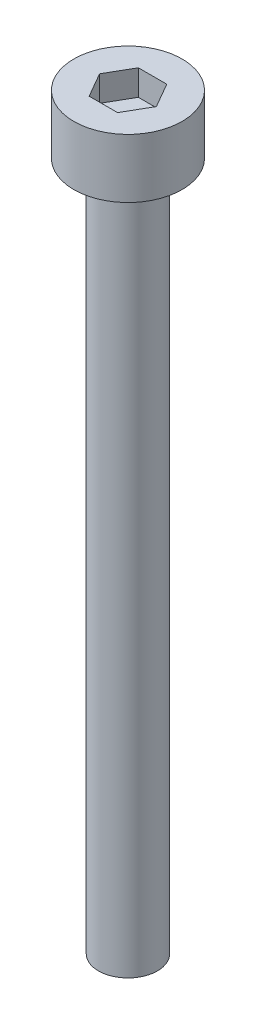
ISO-10303-21;
HEADER;
FILE_DESCRIPTION(('STEP AP214'),'2;1');
FILE_NAME('part.step','',(''),(''),'','','');
FILE_SCHEMA(('AUTOMOTIVE_DESIGN { 1 0 10303 214 1 1 1 1 }'));
ENDSEC;
DATA;
#1=APPLICATION_CONTEXT('core data for automotive mechanical design processes');
#2=APPLICATION_PROTOCOL_DEFINITION('international standard','automotive_design',2000,#1);
#3=PRODUCT_CONTEXT('',#1,'mechanical');
#4=PRODUCT('Part','Part','',(#3));
#5=PRODUCT_RELATED_PRODUCT_CATEGORY('part','',(#4));
#6=PRODUCT_DEFINITION_FORMATION('','',#4);
#7=PRODUCT_DEFINITION_CONTEXT('part definition',#1,'design');
#8=PRODUCT_DEFINITION('design','',#6,#7);
#9=PRODUCT_DEFINITION_SHAPE('','',#8);
#10=(LENGTH_UNIT() NAMED_UNIT(*) SI_UNIT(.MILLI.,.METRE.));
#11=(NAMED_UNIT(*) PLANE_ANGLE_UNIT() SI_UNIT($,.RADIAN.));
#12=(NAMED_UNIT(*) SI_UNIT($,.STERADIAN.) SOLID_ANGLE_UNIT());
#13=UNCERTAINTY_MEASURE_WITH_UNIT(LENGTH_MEASURE(1.E-05),#10,'distance_accuracy_value','');
#14=(GEOMETRIC_REPRESENTATION_CONTEXT(3) GLOBAL_UNCERTAINTY_ASSIGNED_CONTEXT((#13)) GLOBAL_UNIT_ASSIGNED_CONTEXT((#10,
#11,#12)) REPRESENTATION_CONTEXT('',''));
#15=CARTESIAN_POINT('',(0.,0.,0.));
#16=DIRECTION('',(0.,0.,1.));
#17=DIRECTION('',(1.,0.,0.));
#18=AXIS2_PLACEMENT_3D('',#15,#16,#17);
#19=CARTESIAN_POINT('',(0.,3.,0.));
#20=DIRECTION('',(0.,-1.,0.));
#21=DIRECTION('',(0.,0.,-1.));
#22=AXIS2_PLACEMENT_3D('',#19,#20,#21);
#23=CYLINDRICAL_SURFACE('',#22,2.75);
#24=CARTESIAN_POINT('',(0.,3.,0.));
#25=DIRECTION('',(0.,1.,0.));
#26=DIRECTION('',(0.,0.,1.));
#27=AXIS2_PLACEMENT_3D('',#24,#25,#26);
#28=CIRCLE('',#27,2.75);
#29=CARTESIAN_POINT('',(0.,3.,2.75));
#30=VERTEX_POINT('',#29);
#31=EDGE_CURVE('E45',#30,#30,#28,.T.);
#32=ORIENTED_EDGE('',*,*,#31,.F.);
#33=EDGE_LOOP('',(#32));
#34=FACE_BOUND('',#33,.T.);
#35=CARTESIAN_POINT('',(0.,0.,0.));
#36=DIRECTION('',(0.,1.,0.));
#37=DIRECTION('',(0.,0.,1.));
#38=AXIS2_PLACEMENT_3D('',#35,#36,#37);
#39=CIRCLE('',#38,2.75);
#40=CARTESIAN_POINT('',(0.,0.,2.75));
#41=VERTEX_POINT('',#40);
#42=EDGE_CURVE('E40',#41,#41,#39,.T.);
#43=ORIENTED_EDGE('',*,*,#42,.T.);
#44=EDGE_LOOP('',(#43));
#45=FACE_BOUND('',#44,.T.);
#46=ADVANCED_FACE('F37',(#34,#45),#23,.T.);
#47=CARTESIAN_POINT('',(0.,3.,0.));
#48=DIRECTION('',(0.,1.,0.));
#49=DIRECTION('',(0.,0.,1.));
#50=AXIS2_PLACEMENT_3D('',#47,#48,#49);
#51=PLANE('',#50);
#52=DIRECTION('',(0.5,0.,-0.866025403784439));
#53=VECTOR('',#52,1.);
#54=CARTESIAN_POINT('',(0.721687836487032,3.,1.25));
#55=LINE('',#54,#53);
#56=CARTESIAN_POINT('',(0.721687836487032,3.,1.25));
#57=VERTEX_POINT('',#56);
#58=CARTESIAN_POINT('',(1.44337567297406,3.,0.));
#59=VERTEX_POINT('',#58);
#60=EDGE_CURVE('E53',#57,#59,#55,.T.);
#61=ORIENTED_EDGE('',*,*,#60,.F.);
#62=DIRECTION('',(1.,0.,0.));
#63=VECTOR('',#62,1.);
#64=CARTESIAN_POINT('',(-0.721687836487033,3.,1.25));
#65=LINE('',#64,#63);
#66=CARTESIAN_POINT('',(-0.721687836487033,3.,1.25));
#67=VERTEX_POINT('',#66);
#68=EDGE_CURVE('E137',#67,#57,#65,.T.);
#69=ORIENTED_EDGE('',*,*,#68,.F.);
#70=DIRECTION('',(0.5,0.,0.866025403784439));
#71=VECTOR('',#70,1.);
#72=CARTESIAN_POINT('',(-1.44337567297407,3.,0.));
#73=LINE('',#72,#71);
#74=CARTESIAN_POINT('',(-1.44337567297407,3.,0.));
#75=VERTEX_POINT('',#74);
#76=EDGE_CURVE('E135',#75,#67,#73,.T.);
#77=ORIENTED_EDGE('',*,*,#76,.F.);
#78=DIRECTION('',(-0.5,0.,0.866025403784438));
#79=VECTOR('',#78,1.);
#80=CARTESIAN_POINT('',(-0.721687836487033,3.,-1.25));
#81=LINE('',#80,#79);
#82=CARTESIAN_POINT('',(-0.721687836487033,3.,-1.25));
#83=VERTEX_POINT('',#82);
#84=EDGE_CURVE('E101',#83,#75,#81,.T.);
#85=ORIENTED_EDGE('',*,*,#84,.F.);
#86=DIRECTION('',(-1.,0.,0.));
#87=VECTOR('',#86,1.);
#88=CARTESIAN_POINT('',(0.721687836487032,3.,-1.25));
#89=LINE('',#88,#87);
#90=CARTESIAN_POINT('',(0.721687836487032,3.,-1.25));
#91=VERTEX_POINT('',#90);
#92=EDGE_CURVE('E131',#91,#83,#89,.T.);
#93=ORIENTED_EDGE('',*,*,#92,.F.);
#94=DIRECTION('',(-0.5,0.,-0.866025403784439));
#95=VECTOR('',#94,1.);
#96=CARTESIAN_POINT('',(1.44337567297406,3.,0.));
#97=LINE('',#96,#95);
#98=EDGE_CURVE('E127',#59,#91,#97,.T.);
#99=ORIENTED_EDGE('',*,*,#98,.F.);
#100=EDGE_LOOP('',(#61,#69,#77,#85,#93,#99));
#101=FACE_BOUND('',#100,.T.);
#102=ORIENTED_EDGE('',*,*,#31,.T.);
#103=EDGE_LOOP('',(#102));
#104=FACE_BOUND('',#103,.T.);
#105=ADVANCED_FACE('F155',(#101,#104),#51,.T.);
#106=CARTESIAN_POINT('',(0.,0.,0.));
#107=DIRECTION('',(0.,1.,0.));
#108=DIRECTION('',(0.,0.,1.));
#109=AXIS2_PLACEMENT_3D('',#106,#107,#108);
#110=PLANE('',#109);
#111=CARTESIAN_POINT('',(0.,0.,0.));
#112=DIRECTION('',(0.,-1.,0.));
#113=DIRECTION('',(0.,0.,-1.));
#114=AXIS2_PLACEMENT_3D('',#111,#112,#113);
#115=CIRCLE('',#114,1.5);
#116=CARTESIAN_POINT('',(0.,0.,-1.5));
#117=VERTEX_POINT('',#116);
#118=EDGE_CURVE('E11',#117,#117,#115,.T.);
#119=ORIENTED_EDGE('',*,*,#118,.F.);
#120=EDGE_LOOP('',(#119));
#121=FACE_BOUND('',#120,.T.);
#122=ORIENTED_EDGE('',*,*,#42,.F.);
#123=EDGE_LOOP('',(#122));
#124=FACE_BOUND('',#123,.T.);
#125=ADVANCED_FACE('F152',(#121,#124),#110,.F.);
#126=CARTESIAN_POINT('',(0.721687836487032,1.7,1.25));
#127=DIRECTION('',(0.866025403784439,0.,0.5));
#128=DIRECTION('',(0.5,0.,-0.866025403784439));
#129=AXIS2_PLACEMENT_3D('',#126,#127,#128);
#130=PLANE('',#129);
#131=ORIENTED_EDGE('',*,*,#60,.T.);
#132=DIRECTION('',(0.,1.,0.));
#133=VECTOR('',#132,1.);
#134=CARTESIAN_POINT('',(1.44337567297406,1.7,0.));
#135=LINE('',#134,#133);
#136=CARTESIAN_POINT('',(1.44337567297406,1.7,0.));
#137=VERTEX_POINT('',#136);
#138=EDGE_CURVE('E83',#137,#59,#135,.T.);
#139=ORIENTED_EDGE('',*,*,#138,.F.);
#140=DIRECTION('',(0.5,0.,-0.866025403784439));
#141=VECTOR('',#140,1.);
#142=CARTESIAN_POINT('',(0.721687836487032,1.7,1.25));
#143=LINE('',#142,#141);
#144=CARTESIAN_POINT('',(0.721687836487032,1.7,1.25));
#145=VERTEX_POINT('',#144);
#146=EDGE_CURVE('E139',#145,#137,#143,.T.);
#147=ORIENTED_EDGE('',*,*,#146,.F.);
#148=DIRECTION('',(0.,1.,0.));
#149=VECTOR('',#148,1.);
#150=CARTESIAN_POINT('',(0.721687836487032,1.7,1.25));
#151=LINE('',#150,#149);
#152=EDGE_CURVE('E61',#145,#57,#151,.T.);
#153=ORIENTED_EDGE('',*,*,#152,.T.);
#154=EDGE_LOOP('',(#131,#139,#147,#153));
#155=FACE_BOUND('',#154,.T.);
#156=ADVANCED_FACE('F154',(#155),#130,.F.);
#157=CARTESIAN_POINT('',(-0.721687836487033,1.7,1.25));
#158=DIRECTION('',(0.,0.,1.));
#159=DIRECTION('',(1.,0.,0.));
#160=AXIS2_PLACEMENT_3D('',#157,#158,#159);
#161=PLANE('',#160);
#162=ORIENTED_EDGE('',*,*,#68,.T.);
#163=ORIENTED_EDGE('',*,*,#152,.F.);
#164=DIRECTION('',(1.,0.,0.));
#165=VECTOR('',#164,1.);
#166=CARTESIAN_POINT('',(-0.721687836487033,1.7,1.25));
#167=LINE('',#166,#165);
#168=CARTESIAN_POINT('',(-0.721687836487033,1.7,1.25));
#169=VERTEX_POINT('',#168);
#170=EDGE_CURVE('E113',#169,#145,#167,.T.);
#171=ORIENTED_EDGE('',*,*,#170,.F.);
#172=DIRECTION('',(0.,1.,0.));
#173=VECTOR('',#172,1.);
#174=CARTESIAN_POINT('',(-0.721687836487033,1.7,1.25));
#175=LINE('',#174,#173);
#176=EDGE_CURVE('E105',#169,#67,#175,.T.);
#177=ORIENTED_EDGE('',*,*,#176,.T.);
#178=EDGE_LOOP('',(#162,#163,#171,#177));
#179=FACE_BOUND('',#178,.T.);
#180=ADVANCED_FACE('F161',(#179),#161,.F.);
#181=CARTESIAN_POINT('',(-1.44337567297407,1.7,0.));
#182=DIRECTION('',(-0.866025403784439,0.,0.5));
#183=DIRECTION('',(0.5,0.,0.866025403784439));
#184=AXIS2_PLACEMENT_3D('',#181,#182,#183);
#185=PLANE('',#184);
#186=ORIENTED_EDGE('',*,*,#76,.T.);
#187=ORIENTED_EDGE('',*,*,#176,.F.);
#188=DIRECTION('',(0.5,0.,0.866025403784439));
#189=VECTOR('',#188,1.);
#190=CARTESIAN_POINT('',(-1.44337567297407,1.7,0.));
#191=LINE('',#190,#189);
#192=CARTESIAN_POINT('',(-1.44337567297407,1.7,0.));
#193=VERTEX_POINT('',#192);
#194=EDGE_CURVE('E109',#193,#169,#191,.T.);
#195=ORIENTED_EDGE('',*,*,#194,.F.);
#196=DIRECTION('',(0.,1.,0.));
#197=VECTOR('',#196,1.);
#198=CARTESIAN_POINT('',(-1.44337567297407,1.7,0.));
#199=LINE('',#198,#197);
#200=EDGE_CURVE('E94',#193,#75,#199,.T.);
#201=ORIENTED_EDGE('',*,*,#200,.T.);
#202=EDGE_LOOP('',(#186,#187,#195,#201));
#203=FACE_BOUND('',#202,.T.);
#204=ADVANCED_FACE('F110',(#203),#185,.F.);
#205=CARTESIAN_POINT('',(-0.721687836487033,1.7,-1.25));
#206=DIRECTION('',(-0.866025403784439,0.,-0.5));
#207=DIRECTION('',(-0.5,0.,0.866025403784439));
#208=AXIS2_PLACEMENT_3D('',#205,#206,#207);
#209=PLANE('',#208);
#210=ORIENTED_EDGE('',*,*,#84,.T.);
#211=ORIENTED_EDGE('',*,*,#200,.F.);
#212=DIRECTION('',(-0.5,0.,0.866025403784438));
#213=VECTOR('',#212,1.);
#214=CARTESIAN_POINT('',(-0.721687836487033,1.7,-1.25));
#215=LINE('',#214,#213);
#216=CARTESIAN_POINT('',(-0.721687836487033,1.7,-1.25));
#217=VERTEX_POINT('',#216);
#218=EDGE_CURVE('E98',#217,#193,#215,.T.);
#219=ORIENTED_EDGE('',*,*,#218,.F.);
#220=DIRECTION('',(0.,1.,0.));
#221=VECTOR('',#220,1.);
#222=CARTESIAN_POINT('',(-0.721687836487033,1.7,-1.25));
#223=LINE('',#222,#221);
#224=EDGE_CURVE('E106',#217,#83,#223,.T.);
#225=ORIENTED_EDGE('',*,*,#224,.T.);
#226=EDGE_LOOP('',(#210,#211,#219,#225));
#227=FACE_BOUND('',#226,.T.);
#228=ADVANCED_FACE('F96',(#227),#209,.F.);
#229=CARTESIAN_POINT('',(0.721687836487032,1.7,-1.25));
#230=DIRECTION('',(0.,0.,-1.));
#231=DIRECTION('',(-1.,0.,0.));
#232=AXIS2_PLACEMENT_3D('',#229,#230,#231);
#233=PLANE('',#232);
#234=ORIENTED_EDGE('',*,*,#92,.T.);
#235=ORIENTED_EDGE('',*,*,#224,.F.);
#236=DIRECTION('',(-1.,0.,0.));
#237=VECTOR('',#236,1.);
#238=CARTESIAN_POINT('',(0.721687836487032,1.7,-1.25));
#239=LINE('',#238,#237);
#240=CARTESIAN_POINT('',(0.721687836487032,1.7,-1.25));
#241=VERTEX_POINT('',#240);
#242=EDGE_CURVE('E119',#241,#217,#239,.T.);
#243=ORIENTED_EDGE('',*,*,#242,.F.);
#244=DIRECTION('',(0.,1.,0.));
#245=VECTOR('',#244,1.);
#246=CARTESIAN_POINT('',(0.721687836487032,1.7,-1.25));
#247=LINE('',#246,#245);
#248=EDGE_CURVE('E143',#241,#91,#247,.T.);
#249=ORIENTED_EDGE('',*,*,#248,.T.);
#250=EDGE_LOOP('',(#234,#235,#243,#249));
#251=FACE_BOUND('',#250,.T.);
#252=ADVANCED_FACE('F206',(#251),#233,.F.);
#253=CARTESIAN_POINT('',(1.44337567297406,1.7,0.));
#254=DIRECTION('',(0.866025403784439,0.,-0.5));
#255=DIRECTION('',(-0.5,0.,-0.866025403784439));
#256=AXIS2_PLACEMENT_3D('',#253,#254,#255);
#257=PLANE('',#256);
#258=ORIENTED_EDGE('',*,*,#98,.T.);
#259=ORIENTED_EDGE('',*,*,#248,.F.);
#260=DIRECTION('',(-0.5,0.,-0.866025403784439));
#261=VECTOR('',#260,1.);
#262=CARTESIAN_POINT('',(1.44337567297406,1.7,0.));
#263=LINE('',#262,#261);
#264=EDGE_CURVE('E121',#137,#241,#263,.T.);
#265=ORIENTED_EDGE('',*,*,#264,.F.);
#266=ORIENTED_EDGE('',*,*,#138,.T.);
#267=EDGE_LOOP('',(#258,#259,#265,#266));
#268=FACE_BOUND('',#267,.T.);
#269=ADVANCED_FACE('F215',(#268),#257,.F.);
#270=CARTESIAN_POINT('',(0.,1.7,0.));
#271=DIRECTION('',(0.,1.,0.));
#272=DIRECTION('',(0.,0.,1.));
#273=AXIS2_PLACEMENT_3D('',#270,#271,#272);
#274=PLANE('',#273);
#275=ORIENTED_EDGE('',*,*,#146,.T.);
#276=ORIENTED_EDGE('',*,*,#264,.T.);
#277=ORIENTED_EDGE('',*,*,#242,.T.);
#278=ORIENTED_EDGE('',*,*,#218,.T.);
#279=ORIENTED_EDGE('',*,*,#194,.T.);
#280=ORIENTED_EDGE('',*,*,#170,.T.);
#281=EDGE_LOOP('',(#275,#276,#277,#278,#279,#280));
#282=FACE_BOUND('',#281,.T.);
#283=ADVANCED_FACE('F116',(#282),#274,.T.);
#284=CARTESIAN_POINT('',(0.,-35.,0.));
#285=DIRECTION('',(0.,1.,0.));
#286=DIRECTION('',(0.,0.,1.));
#287=AXIS2_PLACEMENT_3D('',#284,#285,#286);
#288=CYLINDRICAL_SURFACE('',#287,1.5);
#289=CARTESIAN_POINT('',(0.,-35.,0.));
#290=DIRECTION('',(0.,-1.,0.));
#291=DIRECTION('',(0.,0.,-1.));
#292=AXIS2_PLACEMENT_3D('',#289,#290,#291);
#293=CIRCLE('',#292,1.5);
#294=CARTESIAN_POINT('',(0.,-35.,-1.5));
#295=VERTEX_POINT('',#294);
#296=EDGE_CURVE('E128',#295,#295,#293,.T.);
#297=ORIENTED_EDGE('',*,*,#296,.F.);
#298=EDGE_LOOP('',(#297));
#299=FACE_BOUND('',#298,.T.);
#300=ORIENTED_EDGE('',*,*,#118,.T.);
#301=EDGE_LOOP('',(#300));
#302=FACE_BOUND('',#301,.T.);
#303=ADVANCED_FACE('F233',(#299,#302),#288,.T.);
#304=CARTESIAN_POINT('',(0.,-35.,0.));
#305=DIRECTION('',(0.,-1.,0.));
#306=DIRECTION('',(0.,0.,-1.));
#307=AXIS2_PLACEMENT_3D('',#304,#305,#306);
#308=PLANE('',#307);
#309=ORIENTED_EDGE('',*,*,#296,.T.);
#310=EDGE_LOOP('',(#309));
#311=FACE_BOUND('',#310,.T.);
#312=ADVANCED_FACE('F247',(#311),#308,.T.);
#313=CLOSED_SHELL('',(#46,#105,#125,#156,#180,#204,#228,#252,#269,#283,#303,#312));
#314=MANIFOLD_SOLID_BREP('B2',#313);
#315=ADVANCED_BREP_SHAPE_REPRESENTATION('',(#18,#314),#14);
#316=SHAPE_DEFINITION_REPRESENTATION(#9,#315);
ENDSEC;
END-ISO-10303-21;
